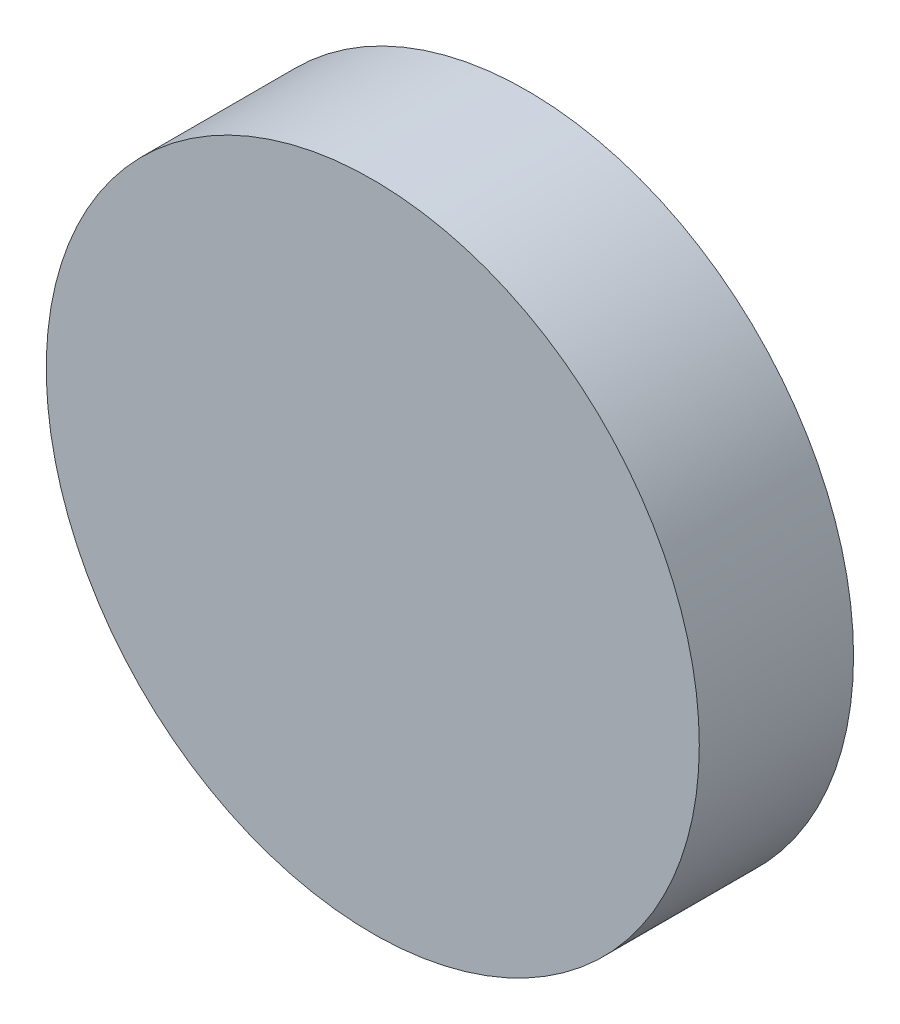
ISO-10303-21;
HEADER;
FILE_DESCRIPTION(('STEP AP214'),'2;1');
FILE_NAME('part.step','',(''),(''),'','','');
FILE_SCHEMA(('AUTOMOTIVE_DESIGN { 1 0 10303 214 1 1 1 1 }'));
ENDSEC;
DATA;
#1=APPLICATION_CONTEXT('core data for automotive mechanical design processes');
#2=APPLICATION_PROTOCOL_DEFINITION('international standard','automotive_design',2000,#1);
#3=PRODUCT_CONTEXT('',#1,'mechanical');
#4=PRODUCT('Part','Part','',(#3));
#5=PRODUCT_RELATED_PRODUCT_CATEGORY('part','',(#4));
#6=PRODUCT_DEFINITION_FORMATION('','',#4);
#7=PRODUCT_DEFINITION_CONTEXT('part definition',#1,'design');
#8=PRODUCT_DEFINITION('design','',#6,#7);
#9=PRODUCT_DEFINITION_SHAPE('','',#8);
#10=(LENGTH_UNIT() NAMED_UNIT(*) SI_UNIT(.MILLI.,.METRE.));
#11=(NAMED_UNIT(*) PLANE_ANGLE_UNIT() SI_UNIT($,.RADIAN.));
#12=(NAMED_UNIT(*) SI_UNIT($,.STERADIAN.) SOLID_ANGLE_UNIT());
#13=UNCERTAINTY_MEASURE_WITH_UNIT(LENGTH_MEASURE(1.E-05),#10,'distance_accuracy_value','');
#14=(GEOMETRIC_REPRESENTATION_CONTEXT(3) GLOBAL_UNCERTAINTY_ASSIGNED_CONTEXT((#13)) GLOBAL_UNIT_ASSIGNED_CONTEXT((#10,
#11,#12)) REPRESENTATION_CONTEXT('',''));
#15=CARTESIAN_POINT('',(0.,0.,0.));
#16=DIRECTION('',(0.,0.,1.));
#17=DIRECTION('',(1.,0.,0.));
#18=AXIS2_PLACEMENT_3D('',#15,#16,#17);
#19=CARTESIAN_POINT('',(0.,0.,6.));
#20=DIRECTION('',(0.,0.,-1.));
#21=DIRECTION('',(-1.,0.,0.));
#22=AXIS2_PLACEMENT_3D('',#19,#20,#21);
#23=CYLINDRICAL_SURFACE('',#22,12.7);
#24=CARTESIAN_POINT('',(0.,0.,6.));
#25=DIRECTION('',(0.,0.,1.));
#26=DIRECTION('',(1.,0.,0.));
#27=AXIS2_PLACEMENT_3D('',#24,#25,#26);
#28=CIRCLE('',#27,12.7);
#29=CARTESIAN_POINT('',(12.7,0.,6.));
#30=VERTEX_POINT('',#29);
#31=EDGE_CURVE('E10',#30,#30,#28,.T.);
#32=ORIENTED_EDGE('',*,*,#31,.F.);
#33=EDGE_LOOP('',(#32));
#34=FACE_BOUND('',#33,.T.);
#35=CARTESIAN_POINT('',(0.,0.,0.));
#36=DIRECTION('',(0.,0.,1.));
#37=DIRECTION('',(1.,0.,0.));
#38=AXIS2_PLACEMENT_3D('',#35,#36,#37);
#39=CIRCLE('',#38,12.7);
#40=CARTESIAN_POINT('',(12.7,0.,0.));
#41=VERTEX_POINT('',#40);
#42=EDGE_CURVE('E42',#41,#41,#39,.T.);
#43=ORIENTED_EDGE('',*,*,#42,.T.);
#44=EDGE_LOOP('',(#43));
#45=FACE_BOUND('',#44,.T.);
#46=ADVANCED_FACE('F39',(#34,#45),#23,.T.);
#47=CARTESIAN_POINT('',(0.,0.,6.));
#48=DIRECTION('',(0.,0.,1.));
#49=DIRECTION('',(1.,0.,0.));
#50=AXIS2_PLACEMENT_3D('',#47,#48,#49);
#51=PLANE('',#50);
#52=ORIENTED_EDGE('',*,*,#31,.T.);
#53=EDGE_LOOP('',(#52));
#54=FACE_BOUND('',#53,.T.);
#55=ADVANCED_FACE('F56',(#54),#51,.T.);
#56=CARTESIAN_POINT('',(0.,0.,0.));
#57=DIRECTION('',(0.,0.,1.));
#58=DIRECTION('',(1.,0.,0.));
#59=AXIS2_PLACEMENT_3D('',#56,#57,#58);
#60=PLANE('',#59);
#61=ORIENTED_EDGE('',*,*,#42,.F.);
#62=EDGE_LOOP('',(#61));
#63=FACE_BOUND('',#62,.T.);
#64=ADVANCED_FACE('F54',(#63),#60,.F.);
#65=CLOSED_SHELL('',(#46,#55,#64));
#66=MANIFOLD_SOLID_BREP('B2',#65);
#67=ADVANCED_BREP_SHAPE_REPRESENTATION('',(#18,#66),#14);
#68=SHAPE_DEFINITION_REPRESENTATION(#9,#67);
ENDSEC;
END-ISO-10303-21;
